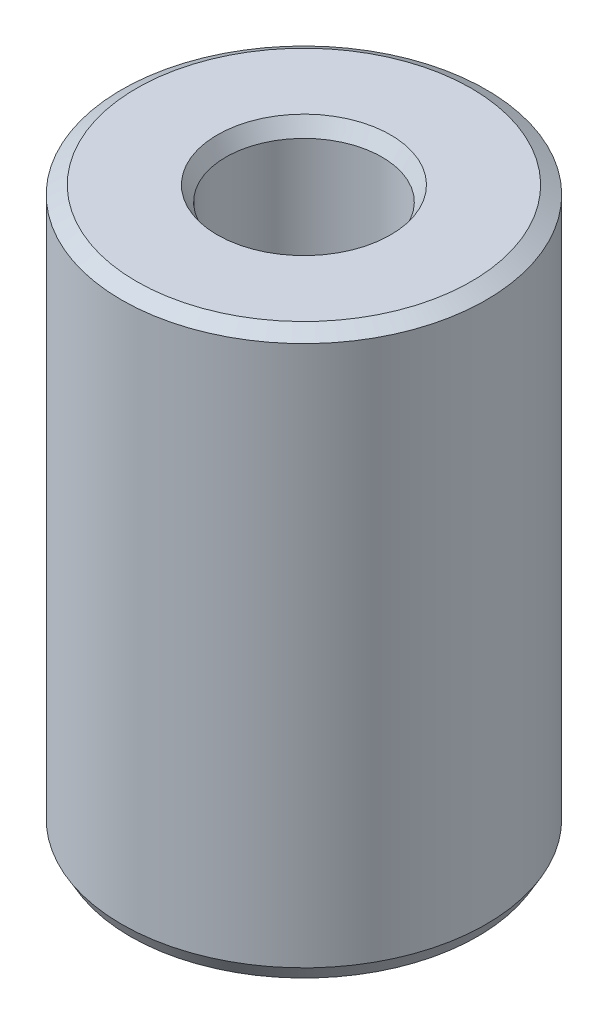
ISO-10303-21;
HEADER;
FILE_DESCRIPTION(('STEP AP214'),'2;1');
FILE_NAME('part.step','',(''),(''),'','','');
FILE_SCHEMA(('AUTOMOTIVE_DESIGN { 1 0 10303 214 1 1 1 1 }'));
ENDSEC;
DATA;
#1=APPLICATION_CONTEXT('core data for automotive mechanical design processes');
#2=APPLICATION_PROTOCOL_DEFINITION('international standard','automotive_design',2000,#1);
#3=PRODUCT_CONTEXT('',#1,'mechanical');
#4=PRODUCT('Part','Part','',(#3));
#5=PRODUCT_RELATED_PRODUCT_CATEGORY('part','',(#4));
#6=PRODUCT_DEFINITION_FORMATION('','',#4);
#7=PRODUCT_DEFINITION_CONTEXT('part definition',#1,'design');
#8=PRODUCT_DEFINITION('design','',#6,#7);
#9=PRODUCT_DEFINITION_SHAPE('','',#8);
#10=(LENGTH_UNIT() NAMED_UNIT(*) SI_UNIT(.MILLI.,.METRE.));
#11=(NAMED_UNIT(*) PLANE_ANGLE_UNIT() SI_UNIT($,.RADIAN.));
#12=(NAMED_UNIT(*) SI_UNIT($,.STERADIAN.) SOLID_ANGLE_UNIT());
#13=UNCERTAINTY_MEASURE_WITH_UNIT(LENGTH_MEASURE(1.E-05),#10,'distance_accuracy_value','');
#14=(GEOMETRIC_REPRESENTATION_CONTEXT(3) GLOBAL_UNCERTAINTY_ASSIGNED_CONTEXT((#13)) GLOBAL_UNIT_ASSIGNED_CONTEXT((#10,
#11,#12)) REPRESENTATION_CONTEXT('',''));
#15=CARTESIAN_POINT('',(0.,0.,0.));
#16=DIRECTION('',(0.,0.,1.));
#17=DIRECTION('',(1.,0.,0.));
#18=AXIS2_PLACEMENT_3D('',#15,#16,#17);
#19=CARTESIAN_POINT('',(0.,85.1134347842334,0.));
#20=DIRECTION('',(0.,-1.,0.));
#21=DIRECTION('',(0.,0.,-1.));
#22=AXIS2_PLACEMENT_3D('',#19,#20,#21);
#23=CYLINDRICAL_SURFACE('',#22,27.5);
#24=CARTESIAN_POINT('',(0.,2.24838552450594,0.));
#25=DIRECTION('',(0.,1.,0.));
#26=DIRECTION('',(0.,0.,1.));
#27=AXIS2_PLACEMENT_3D('',#24,#25,#26);
#28=CIRCLE('',#27,27.5);
#29=CARTESIAN_POINT('',(0.,2.24838552450594,27.5));
#30=VERTEX_POINT('',#29);
#31=EDGE_CURVE('E10',#30,#30,#28,.T.);
#32=ORIENTED_EDGE('',*,*,#31,.T.);
#33=EDGE_LOOP('',(#32));
#34=FACE_BOUND('',#33,.T.);
#35=CARTESIAN_POINT('',(0.,83.8153287964179,0.));
#36=DIRECTION('',(0.,1.,0.));
#37=DIRECTION('',(0.,0.,1.));
#38=AXIS2_PLACEMENT_3D('',#35,#36,#37);
#39=CIRCLE('',#38,27.5);
#40=CARTESIAN_POINT('',(0.,83.8153287964179,27.5));
#41=VERTEX_POINT('',#40);
#42=EDGE_CURVE('E50',#41,#41,#39,.F.);
#43=ORIENTED_EDGE('',*,*,#42,.T.);
#44=EDGE_LOOP('',(#43));
#45=FACE_BOUND('',#44,.T.);
#46=ADVANCED_FACE('F39',(#34,#45),#23,.T.);
#47=CARTESIAN_POINT('',(0.,85.1134347842334,0.));
#48=DIRECTION('',(0.,1.,0.));
#49=DIRECTION('',(0.,0.,1.));
#50=AXIS2_PLACEMENT_3D('',#47,#48,#49);
#51=PLANE('',#50);
#52=CARTESIAN_POINT('',(0.,85.1134347842334,0.));
#53=DIRECTION('',(0.,1.,0.));
#54=DIRECTION('',(0.,0.,1.));
#55=AXIS2_PLACEMENT_3D('',#52,#53,#54);
#56=CIRCLE('',#55,13.0765434699239);
#57=CARTESIAN_POINT('',(0.,85.1134347842334,13.0765434699239));
#58=VERTEX_POINT('',#57);
#59=EDGE_CURVE('E58',#58,#58,#56,.F.);
#60=ORIENTED_EDGE('',*,*,#59,.T.);
#61=EDGE_LOOP('',(#60));
#62=FACE_BOUND('',#61,.T.);
#63=CARTESIAN_POINT('',(0.,85.1134347842334,0.));
#64=DIRECTION('',(0.,1.,0.));
#65=DIRECTION('',(0.,0.,1.));
#66=AXIS2_PLACEMENT_3D('',#63,#64,#65);
#67=CIRCLE('',#66,25.251614475494);
#68=CARTESIAN_POINT('',(0.,85.1134347842334,25.251614475494));
#69=VERTEX_POINT('',#68);
#70=EDGE_CURVE('E61',#69,#69,#67,.T.);
#71=ORIENTED_EDGE('',*,*,#70,.T.);
#72=EDGE_LOOP('',(#71));
#73=FACE_BOUND('',#72,.T.);
#74=ADVANCED_FACE('F88',(#62,#73),#51,.T.);
#75=CARTESIAN_POINT('',(0.,0.,0.));
#76=DIRECTION('',(0.,1.,0.));
#77=DIRECTION('',(0.,0.,1.));
#78=AXIS2_PLACEMENT_3D('',#75,#76,#77);
#79=PLANE('',#78);
#80=CARTESIAN_POINT('',(0.,0.,0.));
#81=DIRECTION('',(0.,1.,0.));
#82=DIRECTION('',(0.,0.,1.));
#83=AXIS2_PLACEMENT_3D('',#80,#81,#82);
#84=CIRCLE('',#83,14.0268230066143);
#85=CARTESIAN_POINT('',(0.,0.,14.0268230066143));
#86=VERTEX_POINT('',#85);
#87=EDGE_CURVE('E51',#86,#86,#84,.T.);
#88=ORIENTED_EDGE('',*,*,#87,.T.);
#89=EDGE_LOOP('',(#88));
#90=FACE_BOUND('',#89,.T.);
#91=CARTESIAN_POINT('',(0.,0.,0.));
#92=DIRECTION('',(0.,1.,0.));
#93=DIRECTION('',(0.,0.,1.));
#94=AXIS2_PLACEMENT_3D('',#91,#92,#93);
#95=CIRCLE('',#94,26.2018940121844);
#96=CARTESIAN_POINT('',(0.,0.,26.2018940121844));
#97=VERTEX_POINT('',#96);
#98=EDGE_CURVE('E54',#97,#97,#95,.F.);
#99=ORIENTED_EDGE('',*,*,#98,.T.);
#100=EDGE_LOOP('',(#99));
#101=FACE_BOUND('',#100,.T.);
#102=ADVANCED_FACE('F83',(#90,#101),#79,.F.);
#103=CARTESIAN_POINT('',(0.,85.1134347842334,0.));
#104=DIRECTION('',(0.,-1.,0.));
#105=DIRECTION('',(0.,0.,-1.));
#106=AXIS2_PLACEMENT_3D('',#103,#104,#105);
#107=CYLINDRICAL_SURFACE('',#106,11.7784374821083);
#108=CARTESIAN_POINT('',(0.,82.8650492597274,0.));
#109=DIRECTION('',(0.,1.,0.));
#110=DIRECTION('',(0.,0.,1.));
#111=AXIS2_PLACEMENT_3D('',#108,#109,#110);
#112=CIRCLE('',#111,11.7784374821083);
#113=CARTESIAN_POINT('',(0.,82.8650492597274,11.7784374821083));
#114=VERTEX_POINT('',#113);
#115=EDGE_CURVE('E67',#114,#114,#112,.T.);
#116=ORIENTED_EDGE('',*,*,#115,.T.);
#117=EDGE_LOOP('',(#116));
#118=FACE_BOUND('',#117,.T.);
#119=CARTESIAN_POINT('',(0.,1.29810598781559,0.));
#120=DIRECTION('',(0.,1.,0.));
#121=DIRECTION('',(0.,0.,1.));
#122=AXIS2_PLACEMENT_3D('',#119,#120,#121);
#123=CIRCLE('',#122,11.7784374821083);
#124=CARTESIAN_POINT('',(0.,1.29810598781559,11.7784374821083));
#125=VERTEX_POINT('',#124);
#126=EDGE_CURVE('E69',#125,#125,#123,.F.);
#127=ORIENTED_EDGE('',*,*,#126,.T.);
#128=EDGE_LOOP('',(#127));
#129=FACE_BOUND('',#128,.T.);
#130=ADVANCED_FACE('F71',(#118,#129),#107,.F.);
#131=CARTESIAN_POINT('',(0.,82.8650492597274,0.));
#132=DIRECTION('',(0.,1.,0.));
#133=DIRECTION('',(0.,0.,1.));
#134=AXIS2_PLACEMENT_3D('',#131,#132,#133);
#135=CONICAL_SURFACE('',#134,11.7784374821083,0.523598775598295);
#136=ORIENTED_EDGE('',*,*,#59,.F.);
#137=EDGE_LOOP('',(#136));
#138=FACE_BOUND('',#137,.T.);
#139=ORIENTED_EDGE('',*,*,#115,.F.);
#140=EDGE_LOOP('',(#139));
#141=FACE_BOUND('',#140,.T.);
#142=ADVANCED_FACE('F77',(#138,#141),#135,.F.);
#143=CARTESIAN_POINT('',(0.,0.,0.));
#144=DIRECTION('',(0.,-1.,0.));
#145=DIRECTION('',(0.,0.,-1.));
#146=AXIS2_PLACEMENT_3D('',#143,#144,#145);
#147=CONICAL_SURFACE('',#146,14.0268230066143,1.04719755119659);
#148=ORIENTED_EDGE('',*,*,#126,.F.);
#149=EDGE_LOOP('',(#148));
#150=FACE_BOUND('',#149,.T.);
#151=ORIENTED_EDGE('',*,*,#87,.F.);
#152=EDGE_LOOP('',(#151));
#153=FACE_BOUND('',#152,.T.);
#154=ADVANCED_FACE('F73',(#150,#153),#147,.F.);
#155=CARTESIAN_POINT('',(0.,2.24838552450594,0.));
#156=DIRECTION('',(0.,1.,0.));
#157=DIRECTION('',(0.,0.,1.));
#158=AXIS2_PLACEMENT_3D('',#155,#156,#157);
#159=CONICAL_SURFACE('',#158,27.5,0.523598775598303);
#160=ORIENTED_EDGE('',*,*,#98,.F.);
#161=EDGE_LOOP('',(#160));
#162=FACE_BOUND('',#161,.T.);
#163=ORIENTED_EDGE('',*,*,#31,.F.);
#164=EDGE_LOOP('',(#163));
#165=FACE_BOUND('',#164,.T.);
#166=ADVANCED_FACE('F76',(#162,#165),#159,.T.);
#167=CARTESIAN_POINT('',(0.,85.1134347842334,0.));
#168=DIRECTION('',(0.,-1.,0.));
#169=DIRECTION('',(0.,0.,-1.));
#170=AXIS2_PLACEMENT_3D('',#167,#168,#169);
#171=CONICAL_SURFACE('',#170,25.251614475494,1.0471975511966);
#172=ORIENTED_EDGE('',*,*,#42,.F.);
#173=EDGE_LOOP('',(#172));
#174=FACE_BOUND('',#173,.T.);
#175=ORIENTED_EDGE('',*,*,#70,.F.);
#176=EDGE_LOOP('',(#175));
#177=FACE_BOUND('',#176,.T.);
#178=ADVANCED_FACE('F45',(#174,#177),#171,.T.);
#179=CLOSED_SHELL('',(#46,#74,#102,#130,#142,#154,#166,#178));
#180=MANIFOLD_SOLID_BREP('B2',#179);
#181=ADVANCED_BREP_SHAPE_REPRESENTATION('',(#18,#180),#14);
#182=SHAPE_DEFINITION_REPRESENTATION(#9,#181);
ENDSEC;
END-ISO-10303-21;
